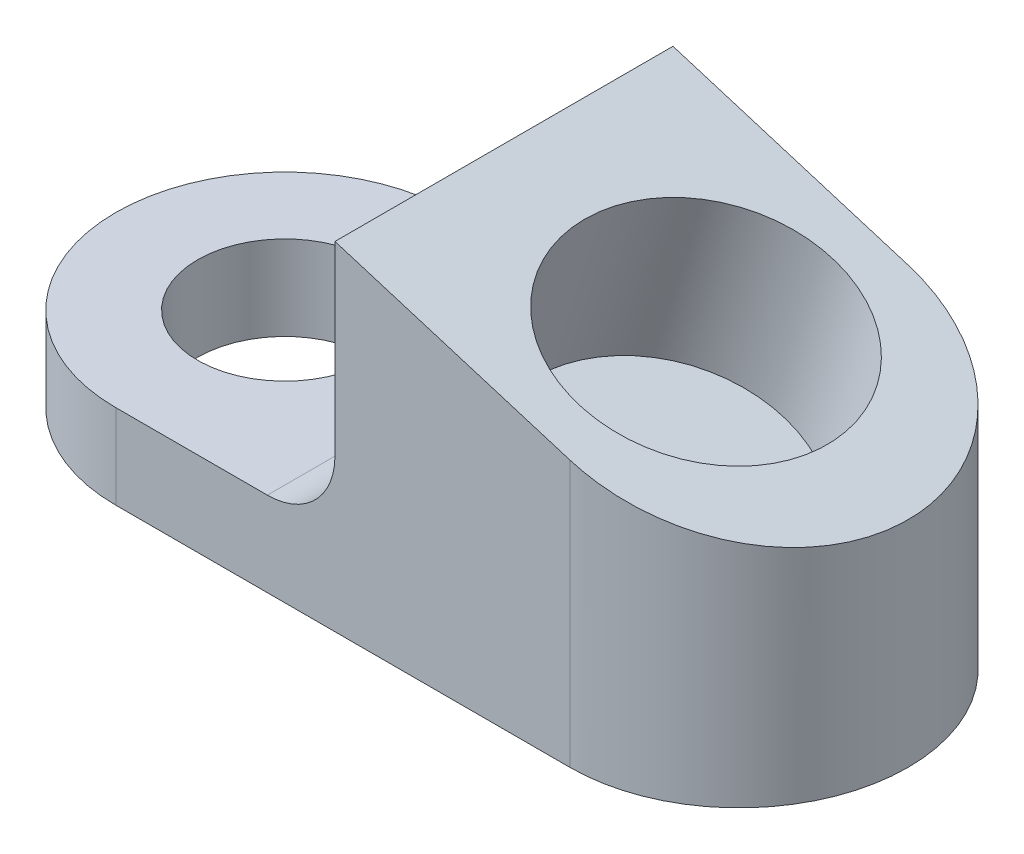
ISO-10303-21;
HEADER;
FILE_DESCRIPTION(('STEP AP214'),'2;1');
FILE_NAME('part.step','',(''),(''),'','','');
FILE_SCHEMA(('AUTOMOTIVE_DESIGN { 1 0 10303 214 1 1 1 1 }'));
ENDSEC;
DATA;
#1=APPLICATION_CONTEXT('core data for automotive mechanical design processes');
#2=APPLICATION_PROTOCOL_DEFINITION('international standard','automotive_design',2000,#1);
#3=PRODUCT_CONTEXT('',#1,'mechanical');
#4=PRODUCT('Part','Part','',(#3));
#5=PRODUCT_RELATED_PRODUCT_CATEGORY('part','',(#4));
#6=PRODUCT_DEFINITION_FORMATION('','',#4);
#7=PRODUCT_DEFINITION_CONTEXT('part definition',#1,'design');
#8=PRODUCT_DEFINITION('design','',#6,#7);
#9=PRODUCT_DEFINITION_SHAPE('','',#8);
#10=(LENGTH_UNIT() NAMED_UNIT(*) SI_UNIT(.MILLI.,.METRE.));
#11=(NAMED_UNIT(*) PLANE_ANGLE_UNIT() SI_UNIT($,.RADIAN.));
#12=(NAMED_UNIT(*) SI_UNIT($,.STERADIAN.) SOLID_ANGLE_UNIT());
#13=UNCERTAINTY_MEASURE_WITH_UNIT(LENGTH_MEASURE(1.E-05),#10,'distance_accuracy_value','');
#14=(GEOMETRIC_REPRESENTATION_CONTEXT(3) GLOBAL_UNCERTAINTY_ASSIGNED_CONTEXT((#13)) GLOBAL_UNIT_ASSIGNED_CONTEXT((#10,
#11,#12)) REPRESENTATION_CONTEXT('',''));
#15=CARTESIAN_POINT('',(0.,0.,0.));
#16=DIRECTION('',(0.,0.,1.));
#17=DIRECTION('',(1.,0.,0.));
#18=AXIS2_PLACEMENT_3D('',#15,#16,#17);
#19=CARTESIAN_POINT('',(0.,0.,12.7));
#20=DIRECTION('',(0.,0.,1.));
#21=DIRECTION('',(1.,0.,0.));
#22=AXIS2_PLACEMENT_3D('',#19,#20,#21);
#23=PLANE('',#22);
#24=DIRECTION('',(0.,-1.,0.));
#25=VECTOR('',#24,1.);
#26=CARTESIAN_POINT('',(32.9435652981309,25.4,12.7));
#27=LINE('',#26,#25);
#28=CARTESIAN_POINT('',(32.9435652981309,25.4,12.7));
#29=VERTEX_POINT('',#28);
#30=CARTESIAN_POINT('',(32.9435652981309,11.43,12.7));
#31=VERTEX_POINT('',#30);
#32=EDGE_CURVE('E121',#29,#31,#27,.T.);
#33=ORIENTED_EDGE('',*,*,#32,.T.);
#34=CARTESIAN_POINT('',(27.8635652981309,11.43,12.7));
#35=DIRECTION('',(0.,0.,1.));
#36=DIRECTION('',(1.,0.,0.));
#37=AXIS2_PLACEMENT_3D('',#34,#35,#36);
#38=CIRCLE('',#37,5.08);
#39=CARTESIAN_POINT('',(27.8635652981309,6.35000000000001,12.7));
#40=VERTEX_POINT('',#39);
#41=EDGE_CURVE('E11',#31,#40,#38,.F.);
#42=ORIENTED_EDGE('',*,*,#41,.T.);
#43=DIRECTION('',(-1.,0.,0.));
#44=VECTOR('',#43,1.);
#45=CARTESIAN_POINT('',(32.9435652981309,6.35000000000001,12.7));
#46=LINE('',#45,#44);
#47=CARTESIAN_POINT('',(16.4717826490655,6.35,12.7));
#48=VERTEX_POINT('',#47);
#49=EDGE_CURVE('E112',#40,#48,#46,.T.);
#50=ORIENTED_EDGE('',*,*,#49,.T.);
#51=DIRECTION('',(0.,1.,0.));
#52=VECTOR('',#51,1.);
#53=CARTESIAN_POINT('',(16.4717826490655,0.,12.7));
#54=LINE('',#53,#52);
#55=CARTESIAN_POINT('',(16.4717826490655,0.,12.7));
#56=VERTEX_POINT('',#55);
#57=EDGE_CURVE('E98',#56,#48,#54,.T.);
#58=ORIENTED_EDGE('',*,*,#57,.F.);
#59=DIRECTION('',(1.,0.,0.));
#60=VECTOR('',#59,1.);
#61=CARTESIAN_POINT('',(0.,0.,12.7));
#62=LINE('',#61,#60);
#63=CARTESIAN_POINT('',(50.6062412999574,0.,12.7));
#64=VERTEX_POINT('',#63);
#65=EDGE_CURVE('E109',#56,#64,#62,.T.);
#66=ORIENTED_EDGE('',*,*,#65,.T.);
#67=DIRECTION('',(0.,-1.,0.));
#68=VECTOR('',#67,1.);
#69=CARTESIAN_POINT('',(50.6062412999574,0.,12.7));
#70=LINE('',#69,#68);
#71=CARTESIAN_POINT('',(50.6062412999574,19.9999780295782,12.7));
#72=VERTEX_POINT('',#71);
#73=EDGE_CURVE('E140',#64,#72,#70,.F.);
#74=ORIENTED_EDGE('',*,*,#73,.T.);
#75=DIRECTION('',(-0.956304755963037,0.29237170472273,0.));
#76=VECTOR('',#75,1.);
#77=CARTESIAN_POINT('',(63.3062412999574,16.1171983750533,12.7));
#78=LINE('',#77,#76);
#79=EDGE_CURVE('E118',#72,#29,#78,.T.);
#80=ORIENTED_EDGE('',*,*,#79,.T.);
#81=EDGE_LOOP('',(#33,#42,#50,#58,#66,#74,#80));
#82=FACE_BOUND('',#81,.T.);
#83=ADVANCED_FACE('F35',(#82),#23,.T.);
#84=CARTESIAN_POINT('',(0.,0.,-12.7));
#85=DIRECTION('',(0.,0.,1.));
#86=DIRECTION('',(1.,0.,0.));
#87=AXIS2_PLACEMENT_3D('',#84,#85,#86);
#88=PLANE('',#87);
#89=DIRECTION('',(0.,1.,0.));
#90=VECTOR('',#89,1.);
#91=CARTESIAN_POINT('',(16.4717826490655,0.,-12.7));
#92=LINE('',#91,#90);
#93=CARTESIAN_POINT('',(16.4717826490655,0.,-12.7));
#94=VERTEX_POINT('',#93);
#95=CARTESIAN_POINT('',(16.4717826490655,6.35,-12.7));
#96=VERTEX_POINT('',#95);
#97=EDGE_CURVE('E101',#94,#96,#92,.T.);
#98=ORIENTED_EDGE('',*,*,#97,.T.);
#99=DIRECTION('',(-1.,0.,0.));
#100=VECTOR('',#99,1.);
#101=CARTESIAN_POINT('',(32.9435652981309,6.35000000000001,-12.7));
#102=LINE('',#101,#100);
#103=CARTESIAN_POINT('',(27.8635652981309,6.35000000000001,-12.7));
#104=VERTEX_POINT('',#103);
#105=EDGE_CURVE('E119',#104,#96,#102,.T.);
#106=ORIENTED_EDGE('',*,*,#105,.F.);
#107=CARTESIAN_POINT('',(27.8635652981309,11.43,-12.7));
#108=DIRECTION('',(0.,0.,1.));
#109=DIRECTION('',(1.,0.,0.));
#110=AXIS2_PLACEMENT_3D('',#107,#108,#109);
#111=CIRCLE('',#110,5.08);
#112=CARTESIAN_POINT('',(32.9435652981309,11.43,-12.7));
#113=VERTEX_POINT('',#112);
#114=EDGE_CURVE('E43',#104,#113,#111,.T.);
#115=ORIENTED_EDGE('',*,*,#114,.T.);
#116=DIRECTION('',(0.,-1.,0.));
#117=VECTOR('',#116,1.);
#118=CARTESIAN_POINT('',(32.9435652981309,25.4,-12.7));
#119=LINE('',#118,#117);
#120=CARTESIAN_POINT('',(32.9435652981309,25.4,-12.7));
#121=VERTEX_POINT('',#120);
#122=EDGE_CURVE('E123',#121,#113,#119,.T.);
#123=ORIENTED_EDGE('',*,*,#122,.F.);
#124=DIRECTION('',(-0.956304755963037,0.29237170472273,0.));
#125=VECTOR('',#124,1.);
#126=CARTESIAN_POINT('',(63.3062412999574,16.1171983750533,-12.7));
#127=LINE('',#126,#125);
#128=CARTESIAN_POINT('',(50.6062412999574,19.9999780295782,-12.7));
#129=VERTEX_POINT('',#128);
#130=EDGE_CURVE('E134',#129,#121,#127,.T.);
#131=ORIENTED_EDGE('',*,*,#130,.F.);
#132=DIRECTION('',(0.,1.,0.));
#133=VECTOR('',#132,1.);
#134=CARTESIAN_POINT('',(50.6062412999574,0.,-12.7));
#135=LINE('',#134,#133);
#136=CARTESIAN_POINT('',(50.6062412999574,0.,-12.7));
#137=VERTEX_POINT('',#136);
#138=EDGE_CURVE('E142',#129,#137,#135,.F.);
#139=ORIENTED_EDGE('',*,*,#138,.T.);
#140=DIRECTION('',(1.,0.,0.));
#141=VECTOR('',#140,1.);
#142=CARTESIAN_POINT('',(0.,0.,-12.7));
#143=LINE('',#142,#141);
#144=EDGE_CURVE('E132',#94,#137,#143,.T.);
#145=ORIENTED_EDGE('',*,*,#144,.F.);
#146=EDGE_LOOP('',(#98,#106,#115,#123,#131,#139,#145));
#147=FACE_BOUND('',#146,.T.);
#148=ADVANCED_FACE('F156',(#147),#88,.F.);
#149=CARTESIAN_POINT('',(50.6062412999574,0.,0.));
#150=DIRECTION('',(0.,1.,0.));
#151=DIRECTION('',(0.,0.,1.));
#152=AXIS2_PLACEMENT_3D('',#149,#150,#151);
#153=CYLINDRICAL_SURFACE('',#152,12.7);
#154=ORIENTED_EDGE('',*,*,#73,.F.);
#155=CARTESIAN_POINT('',(50.6062412999574,0.,0.));
#156=DIRECTION('',(0.,1.,0.));
#157=DIRECTION('',(0.,0.,1.));
#158=AXIS2_PLACEMENT_3D('',#155,#156,#157);
#159=CIRCLE('',#158,12.7);
#160=EDGE_CURVE('E116',#137,#64,#159,.F.);
#161=ORIENTED_EDGE('',*,*,#160,.F.);
#162=ORIENTED_EDGE('',*,*,#138,.F.);
#163=CARTESIAN_POINT('',(50.6062412999574,19.9999780295782,0.));
#164=DIRECTION('',(-0.29237170472273,-0.956304755963037,0.));
#165=DIRECTION('',(-0.956304755963038,0.29237170472273,0.));
#166=AXIS2_PLACEMENT_3D('',#163,#164,#165);
#167=ELLIPSE('',#166,13.2802853073868,12.7);
#168=EDGE_CURVE('E146',#72,#129,#167,.F.);
#169=ORIENTED_EDGE('',*,*,#168,.F.);
#170=EDGE_LOOP('',(#154,#161,#162,#169));
#171=FACE_BOUND('',#170,.T.);
#172=ADVANCED_FACE('F182',(#171),#153,.T.);
#173=CARTESIAN_POINT('',(0.,0.,12.7));
#174=DIRECTION('',(0.,1.,0.));
#175=DIRECTION('',(0.,0.,1.));
#176=AXIS2_PLACEMENT_3D('',#173,#174,#175);
#177=PLANE('',#176);
#178=CARTESIAN_POINT('',(16.4717826490655,0.,0.));
#179=DIRECTION('',(0.,1.,0.));
#180=DIRECTION('',(-1.,0.,0.));
#181=AXIS2_PLACEMENT_3D('',#178,#179,#180);
#182=CIRCLE('',#181,6.5484375);
#183=CARTESIAN_POINT('',(9.92334514906547,0.,0.));
#184=VERTEX_POINT('',#183);
#185=EDGE_CURVE('E160',#184,#184,#182,.T.);
#186=ORIENTED_EDGE('',*,*,#185,.T.);
#187=EDGE_LOOP('',(#186));
#188=FACE_BOUND('',#187,.T.);
#189=ORIENTED_EDGE('',*,*,#65,.F.);
#190=CARTESIAN_POINT('',(16.4717826490655,0.,0.));
#191=DIRECTION('',(0.,-1.,0.));
#192=DIRECTION('',(-1.,0.,0.));
#193=AXIS2_PLACEMENT_3D('',#190,#191,#192);
#194=CIRCLE('',#193,12.7);
#195=EDGE_CURVE('E94',#56,#94,#194,.T.);
#196=ORIENTED_EDGE('',*,*,#195,.T.);
#197=ORIENTED_EDGE('',*,*,#144,.T.);
#198=ORIENTED_EDGE('',*,*,#160,.T.);
#199=EDGE_LOOP('',(#189,#196,#197,#198));
#200=FACE_BOUND('',#199,.T.);
#201=ADVANCED_FACE('F114',(#188,#200),#177,.F.);
#202=CARTESIAN_POINT('',(63.3062412999574,16.1171983750533,12.7));
#203=DIRECTION('',(-0.29237170472273,-0.956304755963037,0.));
#204=DIRECTION('',(0.956304755963038,-0.29237170472273,0.));
#205=AXIS2_PLACEMENT_3D('',#202,#203,#204);
#206=PLANE('',#205);
#207=CARTESIAN_POINT('',(48.1249032990441,20.7585991875267,0.));
#208=DIRECTION('',(0.29237170472273,0.956304755963037,0.));
#209=DIRECTION('',(-0.956304755963037,0.29237170472273,0.));
#210=AXIS2_PLACEMENT_3D('',#207,#208,#209);
#211=CIRCLE('',#210,9.525);
#212=CARTESIAN_POINT('',(39.0161004984962,23.5434396750107,0.));
#213=VERTEX_POINT('',#212);
#214=EDGE_CURVE('E126',#213,#213,#211,.T.);
#215=ORIENTED_EDGE('',*,*,#214,.F.);
#216=EDGE_LOOP('',(#215));
#217=FACE_BOUND('',#216,.T.);
#218=ORIENTED_EDGE('',*,*,#79,.F.);
#219=ORIENTED_EDGE('',*,*,#168,.T.);
#220=ORIENTED_EDGE('',*,*,#130,.T.);
#221=DIRECTION('',(0.,0.,-1.));
#222=VECTOR('',#221,1.);
#223=CARTESIAN_POINT('',(32.9435652981309,25.4,12.7));
#224=LINE('',#223,#222);
#225=EDGE_CURVE('E131',#29,#121,#224,.T.);
#226=ORIENTED_EDGE('',*,*,#225,.F.);
#227=EDGE_LOOP('',(#218,#219,#220,#226));
#228=FACE_BOUND('',#227,.T.);
#229=ADVANCED_FACE('F173',(#217,#228),#206,.F.);
#230=CARTESIAN_POINT('',(32.9435652981309,25.4,12.7));
#231=DIRECTION('',(1.,0.,0.));
#232=DIRECTION('',(0.,0.,-1.));
#233=AXIS2_PLACEMENT_3D('',#230,#231,#232);
#234=PLANE('',#233);
#235=ORIENTED_EDGE('',*,*,#122,.T.);
#236=DIRECTION('',(0.,0.,-1.));
#237=VECTOR('',#236,1.);
#238=CARTESIAN_POINT('',(32.9435652981309,11.43,12.7));
#239=LINE('',#238,#237);
#240=EDGE_CURVE('E50',#113,#31,#239,.F.);
#241=ORIENTED_EDGE('',*,*,#240,.T.);
#242=ORIENTED_EDGE('',*,*,#32,.F.);
#243=ORIENTED_EDGE('',*,*,#225,.T.);
#244=EDGE_LOOP('',(#235,#241,#242,#243));
#245=FACE_BOUND('',#244,.T.);
#246=ADVANCED_FACE('F176',(#245),#234,.F.);
#247=CARTESIAN_POINT('',(32.9435652981309,6.35000000000001,12.7));
#248=DIRECTION('',(0.,-1.,0.));
#249=DIRECTION('',(1.,0.,0.));
#250=AXIS2_PLACEMENT_3D('',#247,#248,#249);
#251=PLANE('',#250);
#252=CARTESIAN_POINT('',(16.4717826490655,6.35,0.));
#253=DIRECTION('',(0.,1.,0.));
#254=DIRECTION('',(-1.,0.,0.));
#255=AXIS2_PLACEMENT_3D('',#252,#253,#254);
#256=CIRCLE('',#255,6.5484375);
#257=CARTESIAN_POINT('',(9.92334514906547,6.35,0.));
#258=VERTEX_POINT('',#257);
#259=EDGE_CURVE('E157',#258,#258,#256,.T.);
#260=ORIENTED_EDGE('',*,*,#259,.F.);
#261=EDGE_LOOP('',(#260));
#262=FACE_BOUND('',#261,.T.);
#263=ORIENTED_EDGE('',*,*,#49,.F.);
#264=DIRECTION('',(0.,0.,-1.));
#265=VECTOR('',#264,1.);
#266=CARTESIAN_POINT('',(27.8635652981309,6.35000000000001,-12.7));
#267=LINE('',#266,#265);
#268=EDGE_CURVE('E148',#40,#104,#267,.T.);
#269=ORIENTED_EDGE('',*,*,#268,.T.);
#270=ORIENTED_EDGE('',*,*,#105,.T.);
#271=CARTESIAN_POINT('',(16.4717826490655,6.35,0.));
#272=DIRECTION('',(0.,-1.,0.));
#273=DIRECTION('',(-1.,0.,0.));
#274=AXIS2_PLACEMENT_3D('',#271,#272,#273);
#275=CIRCLE('',#274,12.7);
#276=EDGE_CURVE('E105',#48,#96,#275,.T.);
#277=ORIENTED_EDGE('',*,*,#276,.F.);
#278=EDGE_LOOP('',(#263,#269,#270,#277));
#279=FACE_BOUND('',#278,.T.);
#280=ADVANCED_FACE('F153',(#262,#279),#251,.F.);
#281=CARTESIAN_POINT('',(44.4117826490655,8.61352878679609,0.));
#282=DIRECTION('',(0.29237170472273,0.956304755963037,0.));
#283=DIRECTION('',(-0.956304755963037,0.29237170472273,0.));
#284=AXIS2_PLACEMENT_3D('',#281,#282,#283);
#285=CYLINDRICAL_SURFACE('',#284,9.525);
#286=CARTESIAN_POINT('',(44.4117826490655,8.61352878679609,0.));
#287=DIRECTION('',(0.29237170472273,0.956304755963037,0.));
#288=DIRECTION('',(-0.956304755963037,0.29237170472273,0.));
#289=AXIS2_PLACEMENT_3D('',#286,#287,#288);
#290=CIRCLE('',#289,9.525);
#291=CARTESIAN_POINT('',(35.3029798485175,11.3983692742801,0.));
#292=VERTEX_POINT('',#291);
#293=EDGE_CURVE('E135',#292,#292,#290,.T.);
#294=ORIENTED_EDGE('',*,*,#293,.F.);
#295=EDGE_LOOP('',(#294));
#296=FACE_BOUND('',#295,.T.);
#297=ORIENTED_EDGE('',*,*,#214,.T.);
#298=EDGE_LOOP('',(#297));
#299=FACE_BOUND('',#298,.T.);
#300=ADVANCED_FACE('F171',(#296,#299),#285,.F.);
#301=CARTESIAN_POINT('',(44.4117826490655,8.61352878679609,0.));
#302=DIRECTION('',(0.29237170472273,0.956304755963037,0.));
#303=DIRECTION('',(-0.956304755963037,0.29237170472273,0.));
#304=AXIS2_PLACEMENT_3D('',#301,#302,#303);
#305=PLANE('',#304);
#306=ORIENTED_EDGE('',*,*,#293,.T.);
#307=EDGE_LOOP('',(#306));
#308=FACE_BOUND('',#307,.T.);
#309=ADVANCED_FACE('F238',(#308),#305,.T.);
#310=CARTESIAN_POINT('',(16.4717826490655,0.,0.));
#311=DIRECTION('',(0.,1.,0.));
#312=DIRECTION('',(-1.,0.,0.));
#313=AXIS2_PLACEMENT_3D('',#310,#311,#312);
#314=CYLINDRICAL_SURFACE('',#313,6.5484375);
#315=CARTESIAN_POINT('',(9.92334514906547,0.,0.));
#316=CARTESIAN_POINT('',(9.92334514906547,0.0661458333333265,0.));
#317=CARTESIAN_POINT('',(9.92334514906547,0.13229166666666,0.));
#318=CARTESIAN_POINT('',(9.92334514906547,0.264583333333327,0.));
#319=CARTESIAN_POINT('',(9.92334514906547,0.33072916666666,0.));
#320=CARTESIAN_POINT('',(9.92334514906547,0.463020833333327,0.));
#321=CARTESIAN_POINT('',(9.92334514906547,0.52916666666666,0.));
#322=CARTESIAN_POINT('',(9.92334514906547,0.661458333333327,0.));
#323=CARTESIAN_POINT('',(9.92334514906547,0.727604166666661,0.));
#324=CARTESIAN_POINT('',(9.92334514906547,0.859895833333327,0.));
#325=CARTESIAN_POINT('',(9.92334514906547,0.926041666666661,0.));
#326=CARTESIAN_POINT('',(9.92334514906547,1.05833333333333,0.));
#327=CARTESIAN_POINT('',(9.92334514906547,1.12447916666666,0.));
#328=CARTESIAN_POINT('',(9.92334514906547,1.25677083333333,0.));
#329=CARTESIAN_POINT('',(9.92334514906547,1.32291666666666,0.));
#330=CARTESIAN_POINT('',(9.92334514906547,1.45520833333333,0.));
#331=CARTESIAN_POINT('',(9.92334514906547,1.52135416666666,0.));
#332=CARTESIAN_POINT('',(9.92334514906547,1.65364583333333,0.));
#333=CARTESIAN_POINT('',(9.92334514906547,1.71979166666666,0.));
#334=CARTESIAN_POINT('',(9.92334514906547,1.85208333333333,0.));
#335=CARTESIAN_POINT('',(9.92334514906547,1.91822916666666,0.));
#336=CARTESIAN_POINT('',(9.92334514906547,2.05052083333333,0.));
#337=CARTESIAN_POINT('',(9.92334514906547,2.11666666666666,0.));
#338=CARTESIAN_POINT('',(9.92334514906547,2.24895833333333,0.));
#339=CARTESIAN_POINT('',(9.92334514906547,2.31510416666666,0.));
#340=CARTESIAN_POINT('',(9.92334514906547,2.44739583333333,0.));
#341=CARTESIAN_POINT('',(9.92334514906547,2.51354166666666,0.));
#342=CARTESIAN_POINT('',(9.92334514906547,2.64583333333333,0.));
#343=CARTESIAN_POINT('',(9.92334514906547,2.71197916666666,0.));
#344=CARTESIAN_POINT('',(9.92334514906547,2.84427083333333,0.));
#345=CARTESIAN_POINT('',(9.92334514906547,2.91041666666666,0.));
#346=CARTESIAN_POINT('',(9.92334514906547,3.04270833333333,0.));
#347=CARTESIAN_POINT('',(9.92334514906547,3.10885416666666,0.));
#348=CARTESIAN_POINT('',(9.92334514906547,3.24114583333333,0.));
#349=CARTESIAN_POINT('',(9.92334514906547,3.30729166666666,0.));
#350=CARTESIAN_POINT('',(9.92334514906547,3.43958333333333,0.));
#351=CARTESIAN_POINT('',(9.92334514906547,3.50572916666666,0.));
#352=CARTESIAN_POINT('',(9.92334514906547,3.63802083333333,0.));
#353=CARTESIAN_POINT('',(9.92334514906547,3.70416666666666,0.));
#354=CARTESIAN_POINT('',(9.92334514906547,3.83645833333333,0.));
#355=CARTESIAN_POINT('',(9.92334514906547,3.90260416666666,0.));
#356=CARTESIAN_POINT('',(9.92334514906547,4.03489583333333,0.));
#357=CARTESIAN_POINT('',(9.92334514906547,4.10104166666666,0.));
#358=CARTESIAN_POINT('',(9.92334514906547,4.23333333333333,0.));
#359=CARTESIAN_POINT('',(9.92334514906547,4.29947916666667,0.));
#360=CARTESIAN_POINT('',(9.92334514906547,4.43177083333333,0.));
#361=CARTESIAN_POINT('',(9.92334514906547,4.49791666666667,0.));
#362=CARTESIAN_POINT('',(9.92334514906547,4.63020833333333,0.));
#363=CARTESIAN_POINT('',(9.92334514906547,4.69635416666666,0.));
#364=CARTESIAN_POINT('',(9.92334514906547,4.82864583333333,0.));
#365=CARTESIAN_POINT('',(9.92334514906547,4.89479166666667,0.));
#366=CARTESIAN_POINT('',(9.92334514906547,5.02708333333333,0.));
#367=CARTESIAN_POINT('',(9.92334514906547,5.09322916666667,0.));
#368=CARTESIAN_POINT('',(9.92334514906547,5.22552083333333,0.));
#369=CARTESIAN_POINT('',(9.92334514906547,5.29166666666667,0.));
#370=CARTESIAN_POINT('',(9.92334514906547,5.42395833333333,0.));
#371=CARTESIAN_POINT('',(9.92334514906547,5.49010416666667,0.));
#372=CARTESIAN_POINT('',(9.92334514906547,5.62239583333333,0.));
#373=CARTESIAN_POINT('',(9.92334514906547,5.68854166666667,0.));
#374=CARTESIAN_POINT('',(9.92334514906547,5.82083333333333,0.));
#375=CARTESIAN_POINT('',(9.92334514906547,5.88697916666667,0.));
#376=CARTESIAN_POINT('',(9.92334514906547,6.01927083333333,0.));
#377=CARTESIAN_POINT('',(9.92334514906547,6.08541666666667,0.));
#378=CARTESIAN_POINT('',(9.92334514906547,6.21770833333333,0.));
#379=CARTESIAN_POINT('',(9.92334514906547,6.28385416666667,0.));
#380=CARTESIAN_POINT('',(9.92334514906547,6.35,0.));
#381=B_SPLINE_CURVE_WITH_KNOTS('',3,(#315,#316,#317,#318,#319,#320,#321,#322,#323,#324,#325,
#326,#327,#328,#329,#330,#331,#332,#333,#334,#335,#336,#337,#338,#339,#340,#341,#342,#343,#344,
#345,#346,#347,#348,#349,#350,#351,#352,#353,#354,#355,#356,#357,#358,#359,#360,#361,#362,#363,
#364,#365,#366,#367,#368,#369,#370,#371,#372,#373,#374,#375,#376,#377,#378,#379,#380),
.UNSPECIFIED.,.F.,.F.,(4,2,2,2,2,2,2,2,2,2,2,2,2,2,2,2,2,2,2,2,2,2,2,2,2,2,2,2,2,2,2,2,4),(0.,
0.1984375,0.396875,0.595312500000001,0.793750000000001,0.992187500000001,1.190625,1.3890625,
1.5875,1.7859375,1.984375,2.1828125,2.38125,2.5796875,2.778125,2.9765625,3.175,3.3734375,
3.571875,3.7703125,3.96875,4.16718750000001,4.365625,4.5640625,4.76250000000001,
4.96093750000001,5.15937500000001,5.35781250000001,5.55625000000001,5.75468750000001,
5.95312500000001,6.15156250000001,6.35000000000001),.UNSPECIFIED.);
#382=EDGE_CURVE('BSEAM188',#184,#258,#381,.T.);
#383=ORIENTED_EDGE('',*,*,#185,.F.);
#384=ORIENTED_EDGE('',*,*,#259,.T.);
#385=ORIENTED_EDGE('',*,*,#382,.T.);
#386=ORIENTED_EDGE('',*,*,#382,.F.);
#387=EDGE_LOOP('',(#383,#385,#384,#386));
#388=FACE_BOUND('',#387,.T.);
#389=ADVANCED_FACE('F188',(#388),#314,.F.);
#390=CARTESIAN_POINT('',(16.4717826490655,0.,0.));
#391=DIRECTION('',(0.,1.,0.));
#392=DIRECTION('',(-1.,0.,0.));
#393=AXIS2_PLACEMENT_3D('',#390,#391,#392);
#394=CYLINDRICAL_SURFACE('',#393,12.7);
#395=ORIENTED_EDGE('',*,*,#276,.T.);
#396=ORIENTED_EDGE('',*,*,#97,.F.);
#397=ORIENTED_EDGE('',*,*,#195,.F.);
#398=ORIENTED_EDGE('',*,*,#57,.T.);
#399=EDGE_LOOP('',(#395,#396,#397,#398));
#400=FACE_BOUND('',#399,.T.);
#401=ADVANCED_FACE('F97',(#400),#394,.T.);
#402=CARTESIAN_POINT('',(27.8635652981309,11.43,12.7));
#403=DIRECTION('',(0.,0.,1.));
#404=DIRECTION('',(1.,0.,0.));
#405=AXIS2_PLACEMENT_3D('',#402,#403,#404);
#406=CYLINDRICAL_SURFACE('',#405,5.08);
#407=ORIENTED_EDGE('',*,*,#41,.F.);
#408=ORIENTED_EDGE('',*,*,#240,.F.);
#409=ORIENTED_EDGE('',*,*,#114,.F.);
#410=ORIENTED_EDGE('',*,*,#268,.F.);
#411=EDGE_LOOP('',(#407,#408,#409,#410));
#412=FACE_BOUND('',#411,.T.);
#413=ADVANCED_FACE('F37',(#412),#406,.F.);
#414=CLOSED_SHELL('',(#83,#148,#172,#201,#229,#246,#280,#300,#309,#389,#401,#413));
#415=MANIFOLD_SOLID_BREP('B2',#414);
#416=ADVANCED_BREP_SHAPE_REPRESENTATION('',(#18,#415),#14);
#417=SHAPE_DEFINITION_REPRESENTATION(#9,#416);
ENDSEC;
END-ISO-10303-21;
